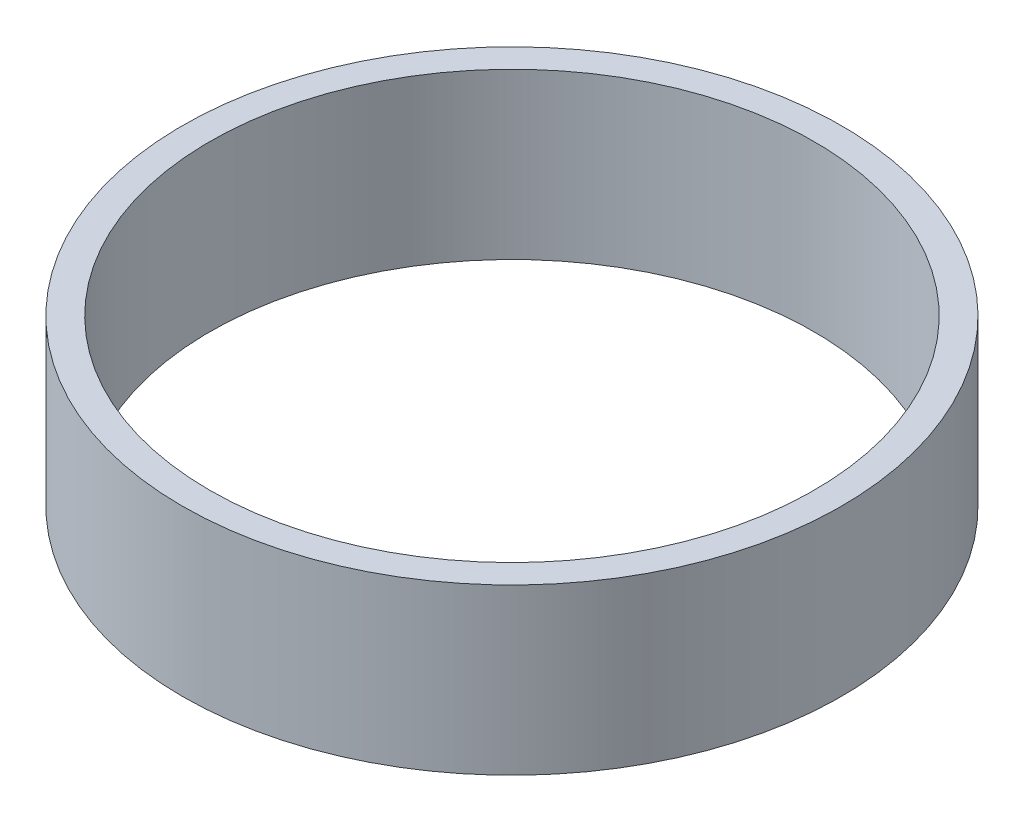
ISO-10303-21;
HEADER;
FILE_DESCRIPTION(('STEP AP214'),'2;1');
FILE_NAME('part.step','',(''),(''),'','','');
FILE_SCHEMA(('AUTOMOTIVE_DESIGN { 1 0 10303 214 1 1 1 1 }'));
ENDSEC;
DATA;
#1=APPLICATION_CONTEXT('core data for automotive mechanical design processes');
#2=APPLICATION_PROTOCOL_DEFINITION('international standard','automotive_design',2000,#1);
#3=PRODUCT_CONTEXT('',#1,'mechanical');
#4=PRODUCT('Part','Part','',(#3));
#5=PRODUCT_RELATED_PRODUCT_CATEGORY('part','',(#4));
#6=PRODUCT_DEFINITION_FORMATION('','',#4);
#7=PRODUCT_DEFINITION_CONTEXT('part definition',#1,'design');
#8=PRODUCT_DEFINITION('design','',#6,#7);
#9=PRODUCT_DEFINITION_SHAPE('','',#8);
#10=(LENGTH_UNIT() NAMED_UNIT(*) SI_UNIT(.MILLI.,.METRE.));
#11=(NAMED_UNIT(*) PLANE_ANGLE_UNIT() SI_UNIT($,.RADIAN.));
#12=(NAMED_UNIT(*) SI_UNIT($,.STERADIAN.) SOLID_ANGLE_UNIT());
#13=UNCERTAINTY_MEASURE_WITH_UNIT(LENGTH_MEASURE(1.E-05),#10,'distance_accuracy_value','');
#14=(GEOMETRIC_REPRESENTATION_CONTEXT(3) GLOBAL_UNCERTAINTY_ASSIGNED_CONTEXT((#13)) GLOBAL_UNIT_ASSIGNED_CONTEXT((#10,
#11,#12)) REPRESENTATION_CONTEXT('',''));
#15=CARTESIAN_POINT('',(0.,0.,0.));
#16=DIRECTION('',(0.,0.,1.));
#17=DIRECTION('',(1.,0.,0.));
#18=AXIS2_PLACEMENT_3D('',#15,#16,#17);
#19=CARTESIAN_POINT('',(0.,30.,0.));
#20=DIRECTION('',(0.,-1.,0.));
#21=DIRECTION('',(0.,0.,-1.));
#22=AXIS2_PLACEMENT_3D('',#19,#20,#21);
#23=CYLINDRICAL_SURFACE('',#22,60.);
#24=CARTESIAN_POINT('',(0.,30.,0.));
#25=DIRECTION('',(0.,1.,0.));
#26=DIRECTION('',(0.,0.,1.));
#27=AXIS2_PLACEMENT_3D('',#24,#25,#26);
#28=CIRCLE('',#27,60.);
#29=CARTESIAN_POINT('',(0.,30.,60.));
#30=VERTEX_POINT('',#29);
#31=EDGE_CURVE('E10',#30,#30,#28,.T.);
#32=ORIENTED_EDGE('',*,*,#31,.F.);
#33=EDGE_LOOP('',(#32));
#34=FACE_BOUND('',#33,.T.);
#35=CARTESIAN_POINT('',(0.,0.,0.));
#36=DIRECTION('',(0.,1.,0.));
#37=DIRECTION('',(0.,0.,1.));
#38=AXIS2_PLACEMENT_3D('',#35,#36,#37);
#39=CIRCLE('',#38,60.);
#40=CARTESIAN_POINT('',(0.,0.,60.));
#41=VERTEX_POINT('',#40);
#42=EDGE_CURVE('E35',#41,#41,#39,.T.);
#43=ORIENTED_EDGE('',*,*,#42,.T.);
#44=EDGE_LOOP('',(#43));
#45=FACE_BOUND('',#44,.T.);
#46=ADVANCED_FACE('F32',(#34,#45),#23,.T.);
#47=CARTESIAN_POINT('',(0.,30.,0.));
#48=DIRECTION('',(0.,1.,0.));
#49=DIRECTION('',(0.,0.,1.));
#50=AXIS2_PLACEMENT_3D('',#47,#48,#49);
#51=PLANE('',#50);
#52=CARTESIAN_POINT('',(0.,30.,0.));
#53=DIRECTION('',(0.,1.,0.));
#54=DIRECTION('',(0.,0.,1.));
#55=AXIS2_PLACEMENT_3D('',#52,#53,#54);
#56=CIRCLE('',#55,55.);
#57=CARTESIAN_POINT('',(0.,30.,55.));
#58=VERTEX_POINT('',#57);
#59=EDGE_CURVE('E42',#58,#58,#56,.T.);
#60=ORIENTED_EDGE('',*,*,#59,.F.);
#61=EDGE_LOOP('',(#60));
#62=FACE_BOUND('',#61,.T.);
#63=ORIENTED_EDGE('',*,*,#31,.T.);
#64=EDGE_LOOP('',(#63));
#65=FACE_BOUND('',#64,.T.);
#66=ADVANCED_FACE('F53',(#62,#65),#51,.T.);
#67=CARTESIAN_POINT('',(0.,0.,0.));
#68=DIRECTION('',(0.,1.,0.));
#69=DIRECTION('',(0.,0.,1.));
#70=AXIS2_PLACEMENT_3D('',#67,#68,#69);
#71=PLANE('',#70);
#72=CARTESIAN_POINT('',(0.,0.,0.));
#73=DIRECTION('',(0.,1.,0.));
#74=DIRECTION('',(0.,0.,1.));
#75=AXIS2_PLACEMENT_3D('',#72,#73,#74);
#76=CIRCLE('',#75,55.);
#77=CARTESIAN_POINT('',(0.,0.,55.));
#78=VERTEX_POINT('',#77);
#79=EDGE_CURVE('E44',#78,#78,#76,.T.);
#80=ORIENTED_EDGE('',*,*,#79,.T.);
#81=EDGE_LOOP('',(#80));
#82=FACE_BOUND('',#81,.T.);
#83=ORIENTED_EDGE('',*,*,#42,.F.);
#84=EDGE_LOOP('',(#83));
#85=FACE_BOUND('',#84,.T.);
#86=ADVANCED_FACE('F55',(#82,#85),#71,.F.);
#87=CARTESIAN_POINT('',(0.,30.,0.));
#88=DIRECTION('',(0.,-1.,0.));
#89=DIRECTION('',(0.,0.,-1.));
#90=AXIS2_PLACEMENT_3D('',#87,#88,#89);
#91=CYLINDRICAL_SURFACE('',#90,55.);
#92=ORIENTED_EDGE('',*,*,#59,.T.);
#93=EDGE_LOOP('',(#92));
#94=FACE_BOUND('',#93,.T.);
#95=ORIENTED_EDGE('',*,*,#79,.F.);
#96=EDGE_LOOP('',(#95));
#97=FACE_BOUND('',#96,.T.);
#98=ADVANCED_FACE('F50',(#94,#97),#91,.F.);
#99=CLOSED_SHELL('',(#46,#66,#86,#98));
#100=MANIFOLD_SOLID_BREP('B2',#99);
#101=ADVANCED_BREP_SHAPE_REPRESENTATION('',(#18,#100),#14);
#102=SHAPE_DEFINITION_REPRESENTATION(#9,#101);
ENDSEC;
END-ISO-10303-21;
